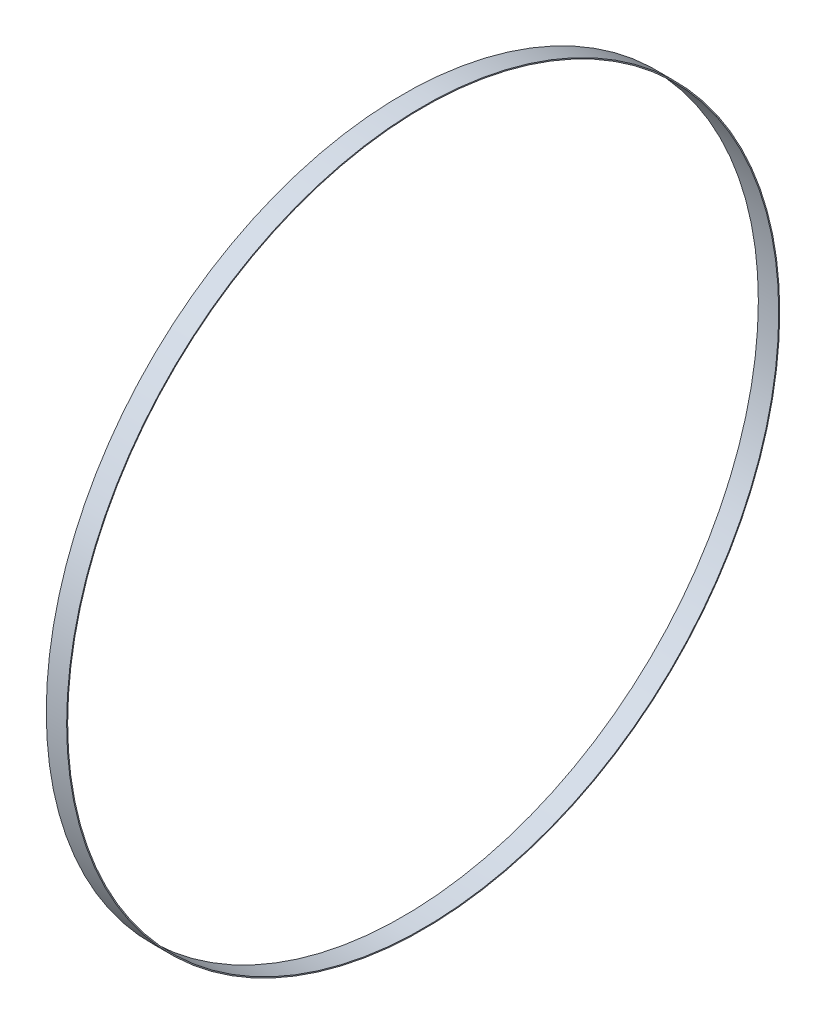
ISO-10303-21;
HEADER;
FILE_DESCRIPTION(('STEP AP214'),'2;1');
FILE_NAME('part.step','',(''),(''),'','','');
FILE_SCHEMA(('AUTOMOTIVE_DESIGN { 1 0 10303 214 1 1 1 1 }'));
ENDSEC;
DATA;
#1=APPLICATION_CONTEXT('core data for automotive mechanical design processes');
#2=APPLICATION_PROTOCOL_DEFINITION('international standard','automotive_design',2000,#1);
#3=PRODUCT_CONTEXT('',#1,'mechanical');
#4=PRODUCT('Part','Part','',(#3));
#5=PRODUCT_RELATED_PRODUCT_CATEGORY('part','',(#4));
#6=PRODUCT_DEFINITION_FORMATION('','',#4);
#7=PRODUCT_DEFINITION_CONTEXT('part definition',#1,'design');
#8=PRODUCT_DEFINITION('design','',#6,#7);
#9=PRODUCT_DEFINITION_SHAPE('','',#8);
#10=(LENGTH_UNIT() NAMED_UNIT(*) SI_UNIT(.MILLI.,.METRE.));
#11=(NAMED_UNIT(*) PLANE_ANGLE_UNIT() SI_UNIT($,.RADIAN.));
#12=(NAMED_UNIT(*) SI_UNIT($,.STERADIAN.) SOLID_ANGLE_UNIT());
#13=UNCERTAINTY_MEASURE_WITH_UNIT(LENGTH_MEASURE(1.E-05),#10,'distance_accuracy_value','');
#14=(GEOMETRIC_REPRESENTATION_CONTEXT(3) GLOBAL_UNCERTAINTY_ASSIGNED_CONTEXT((#13)) GLOBAL_UNIT_ASSIGNED_CONTEXT((#10,
#11,#12)) REPRESENTATION_CONTEXT('',''));
#15=CARTESIAN_POINT('',(0.,0.,0.));
#16=DIRECTION('',(0.,0.,1.));
#17=DIRECTION('',(1.,0.,0.));
#18=AXIS2_PLACEMENT_3D('',#15,#16,#17);
#19=CARTESIAN_POINT('',(1.,0.,0.));
#20=DIRECTION('',(1.,0.,0.));
#21=DIRECTION('',(0.,0.,-1.));
#22=AXIS2_PLACEMENT_3D('',#19,#20,#21);
#23=PLANE('',#22);
#24=CARTESIAN_POINT('',(1.,0.,0.));
#25=DIRECTION('',(1.,0.,0.));
#26=DIRECTION('',(0.,0.,-1.));
#27=AXIS2_PLACEMENT_3D('',#24,#25,#26);
#28=CIRCLE('',#27,17.5);
#29=CARTESIAN_POINT('',(1.,0.,-17.5));
#30=VERTEX_POINT('',#29);
#31=EDGE_CURVE('E10',#30,#30,#28,.T.);
#32=ORIENTED_EDGE('',*,*,#31,.T.);
#33=EDGE_LOOP('',(#32));
#34=FACE_BOUND('',#33,.T.);
#35=CARTESIAN_POINT('',(1.,0.,0.));
#36=DIRECTION('',(1.,0.,0.));
#37=DIRECTION('',(0.,0.,-1.));
#38=AXIS2_PLACEMENT_3D('',#35,#36,#37);
#39=CIRCLE('',#38,17.45);
#40=CARTESIAN_POINT('',(1.,0.,-17.45));
#41=VERTEX_POINT('',#40);
#42=EDGE_CURVE('E42',#41,#41,#39,.T.);
#43=ORIENTED_EDGE('',*,*,#42,.F.);
#44=EDGE_LOOP('',(#43));
#45=FACE_BOUND('',#44,.T.);
#46=ADVANCED_FACE('F31',(#34,#45),#23,.T.);
#47=CARTESIAN_POINT('',(0.,0.,0.));
#48=DIRECTION('',(1.,0.,0.));
#49=DIRECTION('',(0.,0.,-1.));
#50=AXIS2_PLACEMENT_3D('',#47,#48,#49);
#51=PLANE('',#50);
#52=CARTESIAN_POINT('',(0.,0.,0.));
#53=DIRECTION('',(1.,0.,0.));
#54=DIRECTION('',(0.,0.,-1.));
#55=AXIS2_PLACEMENT_3D('',#52,#53,#54);
#56=CIRCLE('',#55,17.5);
#57=CARTESIAN_POINT('',(0.,0.,-17.5));
#58=VERTEX_POINT('',#57);
#59=EDGE_CURVE('E35',#58,#58,#56,.T.);
#60=ORIENTED_EDGE('',*,*,#59,.F.);
#61=EDGE_LOOP('',(#60));
#62=FACE_BOUND('',#61,.T.);
#63=CARTESIAN_POINT('',(0.,0.,0.));
#64=DIRECTION('',(1.,0.,0.));
#65=DIRECTION('',(0.,0.,-1.));
#66=AXIS2_PLACEMENT_3D('',#63,#64,#65);
#67=CIRCLE('',#66,17.45);
#68=CARTESIAN_POINT('',(0.,0.,-17.45));
#69=VERTEX_POINT('',#68);
#70=EDGE_CURVE('E44',#69,#69,#67,.T.);
#71=ORIENTED_EDGE('',*,*,#70,.T.);
#72=EDGE_LOOP('',(#71));
#73=FACE_BOUND('',#72,.T.);
#74=ADVANCED_FACE('F54',(#62,#73),#51,.F.);
#75=CARTESIAN_POINT('',(1.,0.,0.));
#76=DIRECTION('',(-1.,0.,0.));
#77=DIRECTION('',(0.,0.,1.));
#78=AXIS2_PLACEMENT_3D('',#75,#76,#77);
#79=CYLINDRICAL_SURFACE('',#78,17.5);
#80=ORIENTED_EDGE('',*,*,#31,.F.);
#81=EDGE_LOOP('',(#80));
#82=FACE_BOUND('',#81,.T.);
#83=ORIENTED_EDGE('',*,*,#59,.T.);
#84=EDGE_LOOP('',(#83));
#85=FACE_BOUND('',#84,.T.);
#86=ADVANCED_FACE('F33',(#82,#85),#79,.T.);
#87=CARTESIAN_POINT('',(1.,0.,0.));
#88=DIRECTION('',(-1.,0.,0.));
#89=DIRECTION('',(0.,0.,1.));
#90=AXIS2_PLACEMENT_3D('',#87,#88,#89);
#91=CYLINDRICAL_SURFACE('',#90,17.45);
#92=ORIENTED_EDGE('',*,*,#42,.T.);
#93=EDGE_LOOP('',(#92));
#94=FACE_BOUND('',#93,.T.);
#95=ORIENTED_EDGE('',*,*,#70,.F.);
#96=EDGE_LOOP('',(#95));
#97=FACE_BOUND('',#96,.T.);
#98=ADVANCED_FACE('F50',(#94,#97),#91,.F.);
#99=CLOSED_SHELL('',(#46,#74,#86,#98));
#100=MANIFOLD_SOLID_BREP('B2',#99);
#101=ADVANCED_BREP_SHAPE_REPRESENTATION('',(#18,#100),#14);
#102=SHAPE_DEFINITION_REPRESENTATION(#9,#101);
ENDSEC;
END-ISO-10303-21;
